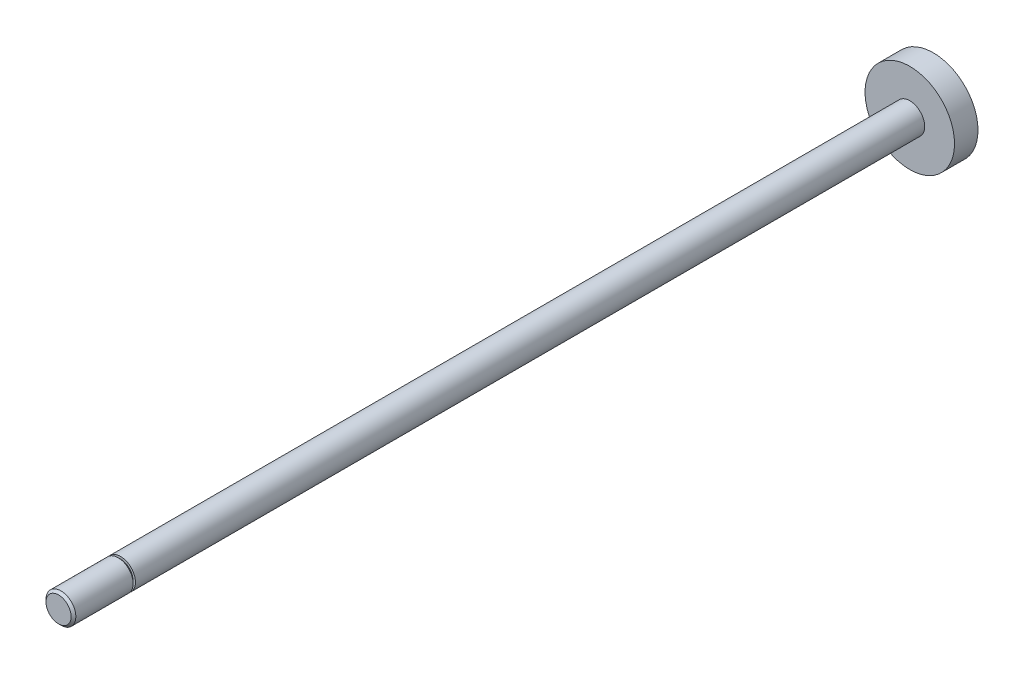
ISO-10303-21;
HEADER;
FILE_DESCRIPTION(('STEP AP214'),'2;1');
FILE_NAME('part.step','',(''),(''),'','','');
FILE_SCHEMA(('AUTOMOTIVE_DESIGN { 1 0 10303 214 1 1 1 1 }'));
ENDSEC;
DATA;
#1=APPLICATION_CONTEXT('core data for automotive mechanical design processes');
#2=APPLICATION_PROTOCOL_DEFINITION('international standard','automotive_design',2000,#1);
#3=PRODUCT_CONTEXT('',#1,'mechanical');
#4=PRODUCT('Part','Part','',(#3));
#5=PRODUCT_RELATED_PRODUCT_CATEGORY('part','',(#4));
#6=PRODUCT_DEFINITION_FORMATION('','',#4);
#7=PRODUCT_DEFINITION_CONTEXT('part definition',#1,'design');
#8=PRODUCT_DEFINITION('design','',#6,#7);
#9=PRODUCT_DEFINITION_SHAPE('','',#8);
#10=(LENGTH_UNIT() NAMED_UNIT(*) SI_UNIT(.MILLI.,.METRE.));
#11=(NAMED_UNIT(*) PLANE_ANGLE_UNIT() SI_UNIT($,.RADIAN.));
#12=(NAMED_UNIT(*) SI_UNIT($,.STERADIAN.) SOLID_ANGLE_UNIT());
#13=UNCERTAINTY_MEASURE_WITH_UNIT(LENGTH_MEASURE(1.E-05),#10,'distance_accuracy_value','');
#14=(GEOMETRIC_REPRESENTATION_CONTEXT(3) GLOBAL_UNCERTAINTY_ASSIGNED_CONTEXT((#13)) GLOBAL_UNIT_ASSIGNED_CONTEXT((#10,
#11,#12)) REPRESENTATION_CONTEXT('',''));
#15=CARTESIAN_POINT('',(0.,0.,0.));
#16=DIRECTION('',(0.,0.,1.));
#17=DIRECTION('',(1.,0.,0.));
#18=AXIS2_PLACEMENT_3D('',#15,#16,#17);
#19=CARTESIAN_POINT('',(0.,0.,2.5));
#20=DIRECTION('',(0.,0.,-1.));
#21=DIRECTION('',(-1.,0.,0.));
#22=AXIS2_PLACEMENT_3D('',#19,#20,#21);
#23=CYLINDRICAL_SURFACE('',#22,9.525);
#24=CARTESIAN_POINT('',(0.,0.,2.5));
#25=DIRECTION('',(0.,0.,1.));
#26=DIRECTION('',(1.,0.,0.));
#27=AXIS2_PLACEMENT_3D('',#24,#25,#26);
#28=CIRCLE('',#27,9.525);
#29=CARTESIAN_POINT('',(9.525,0.,2.5));
#30=VERTEX_POINT('',#29);
#31=EDGE_CURVE('E40',#30,#30,#28,.T.);
#32=ORIENTED_EDGE('',*,*,#31,.F.);
#33=EDGE_LOOP('',(#32));
#34=FACE_BOUND('',#33,.T.);
#35=CARTESIAN_POINT('',(0.,0.,-2.5));
#36=DIRECTION('',(0.,0.,1.));
#37=DIRECTION('',(1.,0.,0.));
#38=AXIS2_PLACEMENT_3D('',#35,#36,#37);
#39=CIRCLE('',#38,9.525);
#40=CARTESIAN_POINT('',(9.525,0.,-2.5));
#41=VERTEX_POINT('',#40);
#42=EDGE_CURVE('E44',#41,#41,#39,.T.);
#43=ORIENTED_EDGE('',*,*,#42,.T.);
#44=EDGE_LOOP('',(#43));
#45=FACE_BOUND('',#44,.T.);
#46=ADVANCED_FACE('F32',(#34,#45),#23,.T.);
#47=CARTESIAN_POINT('',(0.,0.,2.5));
#48=DIRECTION('',(0.,0.,1.));
#49=DIRECTION('',(1.,0.,0.));
#50=AXIS2_PLACEMENT_3D('',#47,#48,#49);
#51=PLANE('',#50);
#52=CARTESIAN_POINT('',(0.,0.,2.5));
#53=DIRECTION('',(0.,0.,1.));
#54=DIRECTION('',(1.,0.,0.));
#55=AXIS2_PLACEMENT_3D('',#52,#53,#54);
#56=CIRCLE('',#55,3.175);
#57=CARTESIAN_POINT('',(3.175,0.,2.5));
#58=VERTEX_POINT('',#57);
#59=EDGE_CURVE('E10',#58,#58,#56,.T.);
#60=ORIENTED_EDGE('',*,*,#59,.F.);
#61=EDGE_LOOP('',(#60));
#62=FACE_BOUND('',#61,.T.);
#63=ORIENTED_EDGE('',*,*,#31,.T.);
#64=EDGE_LOOP('',(#63));
#65=FACE_BOUND('',#64,.T.);
#66=ADVANCED_FACE('F94',(#62,#65),#51,.T.);
#67=CARTESIAN_POINT('',(0.,0.,-2.5));
#68=DIRECTION('',(0.,0.,1.));
#69=DIRECTION('',(1.,0.,0.));
#70=AXIS2_PLACEMENT_3D('',#67,#68,#69);
#71=PLANE('',#70);
#72=ORIENTED_EDGE('',*,*,#42,.F.);
#73=EDGE_LOOP('',(#72));
#74=FACE_BOUND('',#73,.T.);
#75=ADVANCED_FACE('F91',(#74),#71,.F.);
#76=CARTESIAN_POINT('',(0.,0.,192.749256121069));
#77=DIRECTION('',(0.,0.,-1.));
#78=DIRECTION('',(-1.,0.,0.));
#79=AXIS2_PLACEMENT_3D('',#76,#77,#78);
#80=CYLINDRICAL_SURFACE('',#79,3.175);
#81=CARTESIAN_POINT('',(0.,0.,170.569));
#82=DIRECTION('',(0.,0.,-1.));
#83=DIRECTION('',(-1.,0.,0.));
#84=AXIS2_PLACEMENT_3D('',#81,#82,#83);
#85=CIRCLE('',#84,3.175);
#86=CARTESIAN_POINT('',(-3.175,0.,170.569));
#87=VERTEX_POINT('',#86);
#88=EDGE_CURVE('E36',#87,#87,#85,.T.);
#89=ORIENTED_EDGE('',*,*,#88,.T.);
#90=EDGE_LOOP('',(#89));
#91=FACE_BOUND('',#90,.T.);
#92=ORIENTED_EDGE('',*,*,#59,.T.);
#93=EDGE_LOOP('',(#92));
#94=FACE_BOUND('',#93,.T.);
#95=ADVANCED_FACE('F34',(#91,#94),#80,.T.);
#96=CARTESIAN_POINT('',(0.,2.67499999999999,170.569));
#97=DIRECTION('',(0.,0.,-1.));
#98=DIRECTION('',(-1.,0.,0.));
#99=AXIS2_PLACEMENT_3D('',#96,#97,#98);
#100=PLANE('',#99);
#101=CARTESIAN_POINT('',(0.,0.,170.569));
#102=DIRECTION('',(0.,0.,-1.));
#103=DIRECTION('',(-1.,0.,0.));
#104=AXIS2_PLACEMENT_3D('',#101,#102,#103);
#105=CIRCLE('',#104,2.67499999999999);
#106=CARTESIAN_POINT('',(-2.67499999999999,0.,170.569));
#107=VERTEX_POINT('',#106);
#108=EDGE_CURVE('E61',#107,#107,#105,.T.);
#109=ORIENTED_EDGE('',*,*,#108,.T.);
#110=EDGE_LOOP('',(#109));
#111=FACE_BOUND('',#110,.T.);
#112=ORIENTED_EDGE('',*,*,#88,.F.);
#113=EDGE_LOOP('',(#112));
#114=FACE_BOUND('',#113,.T.);
#115=ADVANCED_FACE('F65',(#111,#114),#100,.F.);
#116=CARTESIAN_POINT('',(0.,3.17499999999999,171.069));
#117=DIRECTION('',(0.,0.,1.));
#118=DIRECTION('',(1.,0.,0.));
#119=AXIS2_PLACEMENT_3D('',#116,#117,#118);
#120=PLANE('',#119);
#121=CARTESIAN_POINT('',(0.,0.,171.069));
#122=DIRECTION('',(0.,0.,-1.));
#123=DIRECTION('',(-1.,0.,0.));
#124=AXIS2_PLACEMENT_3D('',#121,#122,#123);
#125=CIRCLE('',#124,2.67499999999999);
#126=CARTESIAN_POINT('',(-2.67499999999999,0.,171.069));
#127=VERTEX_POINT('',#126);
#128=EDGE_CURVE('E58',#127,#127,#125,.T.);
#129=ORIENTED_EDGE('',*,*,#128,.F.);
#130=EDGE_LOOP('',(#129));
#131=FACE_BOUND('',#130,.T.);
#132=CARTESIAN_POINT('',(0.,0.,171.069));
#133=DIRECTION('',(0.,0.,-1.));
#134=DIRECTION('',(-1.,0.,0.));
#135=AXIS2_PLACEMENT_3D('',#132,#133,#134);
#136=CIRCLE('',#135,3.17499999999999);
#137=CARTESIAN_POINT('',(-3.17499999999999,0.,171.069));
#138=VERTEX_POINT('',#137);
#139=EDGE_CURVE('E55',#138,#138,#136,.T.);
#140=ORIENTED_EDGE('',*,*,#139,.T.);
#141=EDGE_LOOP('',(#140));
#142=FACE_BOUND('',#141,.T.);
#143=ADVANCED_FACE('F72',(#131,#142),#120,.F.);
#144=CARTESIAN_POINT('',(0.,0.,0.));
#145=DIRECTION('',(0.,0.,-1.));
#146=DIRECTION('',(-1.,0.,0.));
#147=AXIS2_PLACEMENT_3D('',#144,#145,#146);
#148=CYLINDRICAL_SURFACE('',#147,2.67499999999999);
#149=ORIENTED_EDGE('',*,*,#108,.F.);
#150=EDGE_LOOP('',(#149));
#151=FACE_BOUND('',#150,.T.);
#152=ORIENTED_EDGE('',*,*,#128,.T.);
#153=EDGE_LOOP('',(#152));
#154=FACE_BOUND('',#153,.T.);
#155=ADVANCED_FACE('F68',(#151,#154),#148,.T.);
#156=CARTESIAN_POINT('',(0.,0.,183.269));
#157=DIRECTION('',(0.,0.,-1.));
#158=DIRECTION('',(-1.,0.,0.));
#159=AXIS2_PLACEMENT_3D('',#156,#157,#158);
#160=CIRCLE('',#159,3.17499999999999);
#161=CARTESIAN_POINT('',(-3.17499999999999,0.,183.269));
#162=VERTEX_POINT('',#161);
#163=EDGE_CURVE('E52',#162,#162,#160,.T.);
#164=ORIENTED_EDGE('',*,*,#163,.T.);
#165=EDGE_LOOP('',(#164));
#166=FACE_BOUND('',#165,.T.);
#167=ORIENTED_EDGE('',*,*,#139,.F.);
#168=EDGE_LOOP('',(#167));
#169=FACE_BOUND('',#168,.T.);
#170=ADVANCED_FACE('F71',(#166,#169),#80,.T.);
#171=CARTESIAN_POINT('',(0.,0.,183.769));
#172=DIRECTION('',(0.,0.,-1.));
#173=DIRECTION('',(-1.,0.,0.));
#174=AXIS2_PLACEMENT_3D('',#171,#172,#173);
#175=CONICAL_SURFACE('',#174,2.67499999999999,0.785398163397452);
#176=ORIENTED_EDGE('',*,*,#163,.F.);
#177=EDGE_LOOP('',(#176));
#178=FACE_BOUND('',#177,.T.);
#179=CARTESIAN_POINT('',(0.,0.,183.769));
#180=DIRECTION('',(0.,0.,-1.));
#181=DIRECTION('',(-1.,0.,0.));
#182=AXIS2_PLACEMENT_3D('',#179,#180,#181);
#183=CIRCLE('',#182,2.67499999999999);
#184=CARTESIAN_POINT('',(-2.67499999999999,0.,183.769));
#185=VERTEX_POINT('',#184);
#186=EDGE_CURVE('E49',#185,#185,#183,.T.);
#187=ORIENTED_EDGE('',*,*,#186,.T.);
#188=EDGE_LOOP('',(#187));
#189=FACE_BOUND('',#188,.T.);
#190=ADVANCED_FACE('F82',(#178,#189),#175,.T.);
#191=CARTESIAN_POINT('',(0.,0.,183.769));
#192=DIRECTION('',(0.,0.,-1.));
#193=DIRECTION('',(-1.,0.,0.));
#194=AXIS2_PLACEMENT_3D('',#191,#192,#193);
#195=PLANE('',#194);
#196=ORIENTED_EDGE('',*,*,#186,.F.);
#197=EDGE_LOOP('',(#196));
#198=FACE_BOUND('',#197,.T.);
#199=ADVANCED_FACE('F87',(#198),#195,.F.);
#200=CLOSED_SHELL('',(#46,#66,#75,#95,#115,#143,#155,#170,#190,#199));
#201=MANIFOLD_SOLID_BREP('B2',#200);
#202=ADVANCED_BREP_SHAPE_REPRESENTATION('',(#18,#201),#14);
#203=SHAPE_DEFINITION_REPRESENTATION(#9,#202);
ENDSEC;
END-ISO-10303-21;
